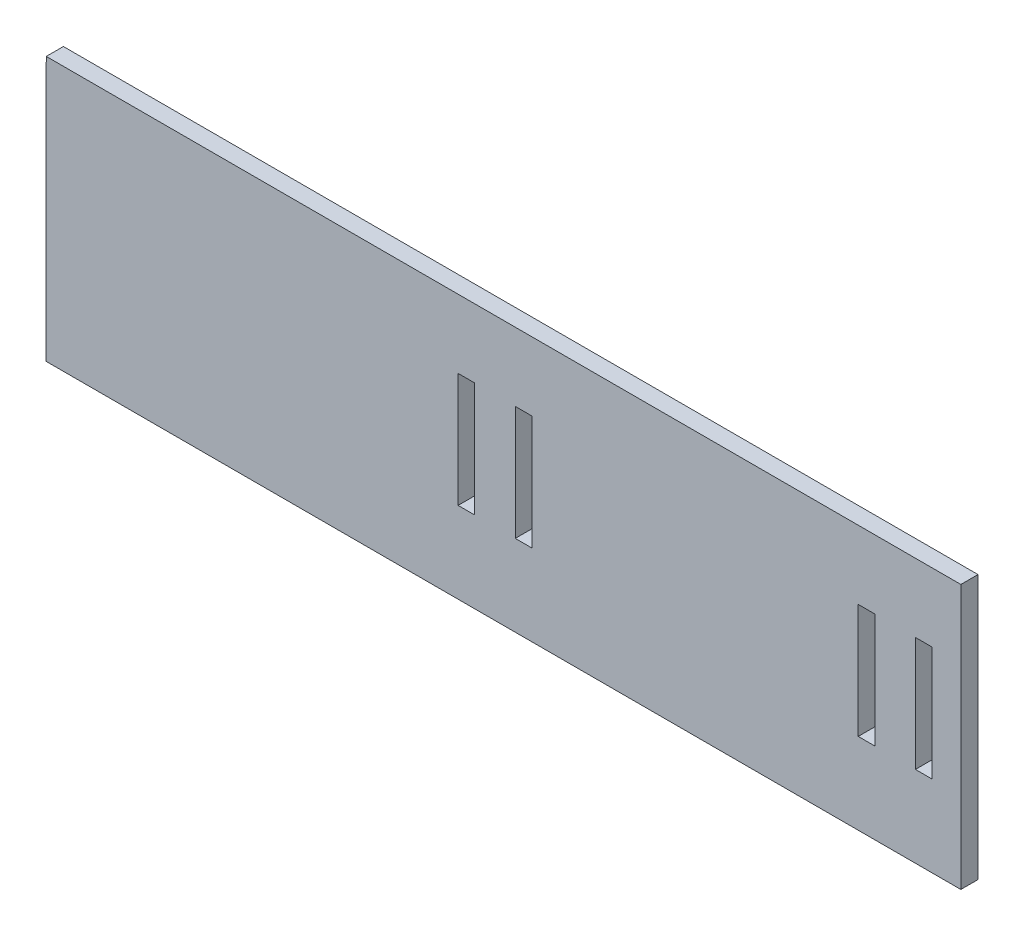
ISO-10303-21;
HEADER;
FILE_DESCRIPTION(('STEP AP214'),'2;1');
FILE_NAME('part.step','',(''),(''),'','','');
FILE_SCHEMA(('AUTOMOTIVE_DESIGN { 1 0 10303 214 1 1 1 1 }'));
ENDSEC;
DATA;
#1=APPLICATION_CONTEXT('core data for automotive mechanical design processes');
#2=APPLICATION_PROTOCOL_DEFINITION('international standard','automotive_design',2000,#1);
#3=PRODUCT_CONTEXT('',#1,'mechanical');
#4=PRODUCT('Part','Part','',(#3));
#5=PRODUCT_RELATED_PRODUCT_CATEGORY('part','',(#4));
#6=PRODUCT_DEFINITION_FORMATION('','',#4);
#7=PRODUCT_DEFINITION_CONTEXT('part definition',#1,'design');
#8=PRODUCT_DEFINITION('design','',#6,#7);
#9=PRODUCT_DEFINITION_SHAPE('','',#8);
#10=(LENGTH_UNIT() NAMED_UNIT(*) SI_UNIT(.MILLI.,.METRE.));
#11=(NAMED_UNIT(*) PLANE_ANGLE_UNIT() SI_UNIT($,.RADIAN.));
#12=(NAMED_UNIT(*) SI_UNIT($,.STERADIAN.) SOLID_ANGLE_UNIT());
#13=UNCERTAINTY_MEASURE_WITH_UNIT(LENGTH_MEASURE(1.E-05),#10,'distance_accuracy_value','');
#14=(GEOMETRIC_REPRESENTATION_CONTEXT(3) GLOBAL_UNCERTAINTY_ASSIGNED_CONTEXT((#13)) GLOBAL_UNIT_ASSIGNED_CONTEXT((#10,
#11,#12)) REPRESENTATION_CONTEXT('',''));
#15=CARTESIAN_POINT('',(0.,0.,0.));
#16=DIRECTION('',(0.,0.,1.));
#17=DIRECTION('',(1.,0.,0.));
#18=AXIS2_PLACEMENT_3D('',#15,#16,#17);
#19=CARTESIAN_POINT('',(87.9999999999733,95.7350879109308,3.00000000000001));
#20=DIRECTION('',(-1.,0.,0.));
#21=DIRECTION('',(0.,-1.,0.));
#22=AXIS2_PLACEMENT_3D('',#19,#20,#21);
#23=PLANE('',#22);
#24=DIRECTION('',(0.,1.,0.));
#25=VECTOR('',#24,1.);
#26=CARTESIAN_POINT('',(87.9999999999733,95.7350879109308,0.));
#27=LINE('',#26,#25);
#28=CARTESIAN_POINT('',(87.9999999999733,49.5183759496248,0.));
#29=VERTEX_POINT('',#28);
#30=CARTESIAN_POINT('',(87.9999999999733,95.7350879109308,0.));
#31=VERTEX_POINT('',#30);
#32=EDGE_CURVE('E296',#29,#31,#27,.T.);
#33=ORIENTED_EDGE('',*,*,#32,.T.);
#34=DIRECTION('',(0.,0.,-1.));
#35=VECTOR('',#34,1.);
#36=CARTESIAN_POINT('',(87.9999999999733,95.7350879109308,3.00000000000001));
#37=LINE('',#36,#35);
#38=CARTESIAN_POINT('',(87.9999999999733,95.7350879109308,3.00000000000001));
#39=VERTEX_POINT('',#38);
#40=EDGE_CURVE('E11',#39,#31,#37,.T.);
#41=ORIENTED_EDGE('',*,*,#40,.F.);
#42=DIRECTION('',(0.,1.,0.));
#43=VECTOR('',#42,1.);
#44=CARTESIAN_POINT('',(87.9999999999733,95.7350879109308,3.00000000000001));
#45=LINE('',#44,#43);
#46=CARTESIAN_POINT('',(87.9999999999733,49.5183759496248,3.00000000000001));
#47=VERTEX_POINT('',#46);
#48=EDGE_CURVE('E303',#47,#39,#45,.T.);
#49=ORIENTED_EDGE('',*,*,#48,.F.);
#50=DIRECTION('',(0.,0.,-1.));
#51=VECTOR('',#50,1.);
#52=CARTESIAN_POINT('',(87.9999999999733,49.5183759496248,3.00000000000001));
#53=LINE('',#52,#51);
#54=EDGE_CURVE('E313',#47,#29,#53,.T.);
#55=ORIENTED_EDGE('',*,*,#54,.T.);
#56=EDGE_LOOP('',(#33,#41,#49,#55));
#57=FACE_BOUND('',#56,.T.);
#58=ADVANCED_FACE('F34',(#57),#23,.F.);
#59=CARTESIAN_POINT('',(87.9999999999733,95.7350879109308,3.00000000000001));
#60=DIRECTION('',(0.,-1.,0.));
#61=DIRECTION('',(1.,0.,0.));
#62=AXIS2_PLACEMENT_3D('',#59,#60,#61);
#63=PLANE('',#62);
#64=DIRECTION('',(-1.,0.,0.));
#65=VECTOR('',#64,1.);
#66=CARTESIAN_POINT('',(87.9999999999733,95.7350879109308,0.));
#67=LINE('',#66,#65);
#68=CARTESIAN_POINT('',(-72.0000742538162,95.7350879109311,0.));
#69=VERTEX_POINT('',#68);
#70=EDGE_CURVE('E316',#31,#69,#67,.T.);
#71=ORIENTED_EDGE('',*,*,#70,.T.);
#72=DIRECTION('',(0.,0.,-1.));
#73=VECTOR('',#72,1.);
#74=CARTESIAN_POINT('',(-72.0000742538162,95.7350879109311,3.00000000000001));
#75=LINE('',#74,#73);
#76=CARTESIAN_POINT('',(-72.0000742538162,95.7350879109311,3.00000000000001));
#77=VERTEX_POINT('',#76);
#78=EDGE_CURVE('E41',#77,#69,#75,.T.);
#79=ORIENTED_EDGE('',*,*,#78,.F.);
#80=DIRECTION('',(-1.,0.,0.));
#81=VECTOR('',#80,1.);
#82=CARTESIAN_POINT('',(87.9999999999733,95.7350879109308,3.00000000000001));
#83=LINE('',#82,#81);
#84=EDGE_CURVE('E306',#39,#77,#83,.T.);
#85=ORIENTED_EDGE('',*,*,#84,.F.);
#86=ORIENTED_EDGE('',*,*,#40,.T.);
#87=EDGE_LOOP('',(#71,#79,#85,#86));
#88=FACE_BOUND('',#87,.T.);
#89=ADVANCED_FACE('F345',(#88),#63,.F.);
#90=CARTESIAN_POINT('',(-72.0000742538162,95.7350879109311,3.00000000000001));
#91=DIRECTION('',(0.999999535914031,-0.000963416692323186,0.));
#92=DIRECTION('',(0.000963416692323186,0.999999535914031,0.));
#93=AXIS2_PLACEMENT_3D('',#90,#91,#92);
#94=PLANE('',#93);
#95=DIRECTION('',(-0.000963416692323185,-0.999999535914031,0.));
#96=VECTOR('',#95,1.);
#97=CARTESIAN_POINT('',(-72.0000742538162,95.7350879109311,0.));
#98=LINE('',#97,#96);
#99=CARTESIAN_POINT('',(-72.0446002262479,49.5183759496247,0.));
#100=VERTEX_POINT('',#99);
#101=EDGE_CURVE('E318',#69,#100,#98,.T.);
#102=ORIENTED_EDGE('',*,*,#101,.T.);
#103=DIRECTION('',(0.,0.,-1.));
#104=VECTOR('',#103,1.);
#105=CARTESIAN_POINT('',(-72.0446002262479,49.5183759496247,3.00000000000001));
#106=LINE('',#105,#104);
#107=CARTESIAN_POINT('',(-72.0446002262479,49.5183759496247,3.00000000000001));
#108=VERTEX_POINT('',#107);
#109=EDGE_CURVE('E323',#108,#100,#106,.T.);
#110=ORIENTED_EDGE('',*,*,#109,.F.);
#111=DIRECTION('',(-0.000963416692323185,-0.999999535914031,0.));
#112=VECTOR('',#111,1.);
#113=CARTESIAN_POINT('',(-72.0000742538162,95.7350879109311,3.00000000000001));
#114=LINE('',#113,#112);
#115=EDGE_CURVE('E309',#77,#108,#114,.T.);
#116=ORIENTED_EDGE('',*,*,#115,.F.);
#117=ORIENTED_EDGE('',*,*,#78,.T.);
#118=EDGE_LOOP('',(#102,#110,#116,#117));
#119=FACE_BOUND('',#118,.T.);
#120=ADVANCED_FACE('F330',(#119),#94,.F.);
#121=CARTESIAN_POINT('',(87.9999999999733,49.5183759496248,3.00000000000001));
#122=DIRECTION('',(0.,1.,0.));
#123=DIRECTION('',(-1.,0.,0.));
#124=AXIS2_PLACEMENT_3D('',#121,#122,#123);
#125=PLANE('',#124);
#126=DIRECTION('',(1.,0.,0.));
#127=VECTOR('',#126,1.);
#128=CARTESIAN_POINT('',(87.9999999999733,49.5183759496248,0.));
#129=LINE('',#128,#127);
#130=EDGE_CURVE('E307',#100,#29,#129,.T.);
#131=ORIENTED_EDGE('',*,*,#130,.T.);
#132=ORIENTED_EDGE('',*,*,#54,.F.);
#133=DIRECTION('',(1.,0.,0.));
#134=VECTOR('',#133,1.);
#135=CARTESIAN_POINT('',(87.9999999999733,49.5183759496248,3.00000000000001));
#136=LINE('',#135,#134);
#137=EDGE_CURVE('E311',#108,#47,#136,.T.);
#138=ORIENTED_EDGE('',*,*,#137,.F.);
#139=ORIENTED_EDGE('',*,*,#109,.T.);
#140=EDGE_LOOP('',(#131,#132,#138,#139));
#141=FACE_BOUND('',#140,.T.);
#142=ADVANCED_FACE('F338',(#141),#125,.F.);
#143=CARTESIAN_POINT('',(0.,0.,3.));
#144=DIRECTION('',(0.,0.,-1.));
#145=DIRECTION('',(0.,1.,0.));
#146=AXIS2_PLACEMENT_3D('',#143,#144,#145);
#147=PLANE('',#146);
#148=DIRECTION('',(1.,0.,0.));
#149=VECTOR('',#148,1.);
#150=CARTESIAN_POINT('',(80.0499999999733,63.7350879109455,3.));
#151=LINE('',#150,#149);
#152=CARTESIAN_POINT('',(80.0499999999733,63.7350879109455,3.00000000000001));
#153=VERTEX_POINT('',#152);
#154=CARTESIAN_POINT('',(82.9499999999733,63.7350879109455,3.));
#155=VERTEX_POINT('',#154);
#156=EDGE_CURVE('E197',#153,#155,#151,.T.);
#157=ORIENTED_EDGE('',*,*,#156,.F.);
#158=DIRECTION('',(0.,-1.,0.));
#159=VECTOR('',#158,1.);
#160=CARTESIAN_POINT('',(80.0499999999733,83.7350879109454,3.));
#161=LINE('',#160,#159);
#162=CARTESIAN_POINT('',(80.0499999999733,83.7350879109454,3.));
#163=VERTEX_POINT('',#162);
#164=EDGE_CURVE('E48',#163,#153,#161,.T.);
#165=ORIENTED_EDGE('',*,*,#164,.F.);
#166=DIRECTION('',(-1.,0.,0.));
#167=VECTOR('',#166,1.);
#168=CARTESIAN_POINT('',(80.0499999999733,83.7350879109454,3.));
#169=LINE('',#168,#167);
#170=CARTESIAN_POINT('',(82.9499999999733,83.7350879109454,3.));
#171=VERTEX_POINT('',#170);
#172=EDGE_CURVE('E188',#171,#163,#169,.T.);
#173=ORIENTED_EDGE('',*,*,#172,.F.);
#174=DIRECTION('',(0.,1.,0.));
#175=VECTOR('',#174,1.);
#176=CARTESIAN_POINT('',(82.9499999999733,83.7350879109454,3.));
#177=LINE('',#176,#175);
#178=EDGE_CURVE('E191',#155,#171,#177,.T.);
#179=ORIENTED_EDGE('',*,*,#178,.F.);
#180=EDGE_LOOP('',(#157,#165,#173,#179));
#181=FACE_BOUND('',#180,.T.);
#182=DIRECTION('',(1.,0.,0.));
#183=VECTOR('',#182,1.);
#184=CARTESIAN_POINT('',(70.0499999999973,63.735087910931,3.));
#185=LINE('',#184,#183);
#186=CARTESIAN_POINT('',(70.0499999999973,63.735087910931,3.00000000000001));
#187=VERTEX_POINT('',#186);
#188=CARTESIAN_POINT('',(72.9499999999973,63.735087910931,3.));
#189=VERTEX_POINT('',#188);
#190=EDGE_CURVE('E222',#187,#189,#185,.T.);
#191=ORIENTED_EDGE('',*,*,#190,.F.);
#192=DIRECTION('',(0.,-1.,0.));
#193=VECTOR('',#192,1.);
#194=CARTESIAN_POINT('',(70.0499999999973,83.7350879109296,3.));
#195=LINE('',#194,#193);
#196=CARTESIAN_POINT('',(70.0499999999973,83.7350879109296,3.));
#197=VERTEX_POINT('',#196);
#198=EDGE_CURVE('E203',#197,#187,#195,.T.);
#199=ORIENTED_EDGE('',*,*,#198,.F.);
#200=DIRECTION('',(-1.,0.,0.));
#201=VECTOR('',#200,1.);
#202=CARTESIAN_POINT('',(70.0499999999973,83.7350879109296,3.));
#203=LINE('',#202,#201);
#204=CARTESIAN_POINT('',(72.9499999999973,83.7350879109296,3.));
#205=VERTEX_POINT('',#204);
#206=EDGE_CURVE('E211',#205,#197,#203,.T.);
#207=ORIENTED_EDGE('',*,*,#206,.F.);
#208=DIRECTION('',(0.,1.,0.));
#209=VECTOR('',#208,1.);
#210=CARTESIAN_POINT('',(72.9499999999973,83.7350879109296,3.));
#211=LINE('',#210,#209);
#212=EDGE_CURVE('E225',#189,#205,#211,.T.);
#213=ORIENTED_EDGE('',*,*,#212,.F.);
#214=EDGE_LOOP('',(#191,#199,#207,#213));
#215=FACE_BOUND('',#214,.T.);
#216=DIRECTION('',(1.,0.,0.));
#217=VECTOR('',#216,1.);
#218=CARTESIAN_POINT('',(10.0499999999965,63.735087910931,3.));
#219=LINE('',#218,#217);
#220=CARTESIAN_POINT('',(10.0499999999965,63.735087910931,3.00000000000001));
#221=VERTEX_POINT('',#220);
#222=CARTESIAN_POINT('',(12.9499999999965,63.735087910931,3.));
#223=VERTEX_POINT('',#222);
#224=EDGE_CURVE('E254',#221,#223,#219,.T.);
#225=ORIENTED_EDGE('',*,*,#224,.F.);
#226=DIRECTION('',(0.,-1.,0.));
#227=VECTOR('',#226,1.);
#228=CARTESIAN_POINT('',(10.0499999999965,83.735087910931,3.));
#229=LINE('',#228,#227);
#230=CARTESIAN_POINT('',(10.0499999999965,83.735087910931,3.));
#231=VERTEX_POINT('',#230);
#232=EDGE_CURVE('E232',#231,#221,#229,.T.);
#233=ORIENTED_EDGE('',*,*,#232,.F.);
#234=DIRECTION('',(-1.,0.,0.));
#235=VECTOR('',#234,1.);
#236=CARTESIAN_POINT('',(10.0499999999965,83.735087910931,3.));
#237=LINE('',#236,#235);
#238=CARTESIAN_POINT('',(12.9499999999965,83.735087910931,3.));
#239=VERTEX_POINT('',#238);
#240=EDGE_CURVE('E243',#239,#231,#237,.T.);
#241=ORIENTED_EDGE('',*,*,#240,.F.);
#242=DIRECTION('',(0.,1.,0.));
#243=VECTOR('',#242,1.);
#244=CARTESIAN_POINT('',(12.9499999999965,83.735087910931,3.));
#245=LINE('',#244,#243);
#246=EDGE_CURVE('E257',#223,#239,#245,.T.);
#247=ORIENTED_EDGE('',*,*,#246,.F.);
#248=EDGE_LOOP('',(#225,#233,#241,#247));
#249=FACE_BOUND('',#248,.T.);
#250=DIRECTION('',(1.,0.,0.));
#251=VECTOR('',#250,1.);
#252=CARTESIAN_POINT('',(0.0500000000000025,63.7350879109133,3.));
#253=LINE('',#252,#251);
#254=CARTESIAN_POINT('',(0.0500000000000025,63.7350879109133,3.00000000000001));
#255=VERTEX_POINT('',#254);
#256=CARTESIAN_POINT('',(2.95,63.7350879109133,3.));
#257=VERTEX_POINT('',#256);
#258=EDGE_CURVE('E286',#255,#257,#253,.T.);
#259=ORIENTED_EDGE('',*,*,#258,.F.);
#260=DIRECTION('',(0.,-1.,0.));
#261=VECTOR('',#260,1.);
#262=CARTESIAN_POINT('',(0.0500000000000001,83.7350879109133,3.));
#263=LINE('',#262,#261);
#264=CARTESIAN_POINT('',(0.0500000000000001,83.7350879109133,3.));
#265=VERTEX_POINT('',#264);
#266=EDGE_CURVE('E264',#265,#255,#263,.T.);
#267=ORIENTED_EDGE('',*,*,#266,.F.);
#268=DIRECTION('',(-1.,0.,0.));
#269=VECTOR('',#268,1.);
#270=CARTESIAN_POINT('',(0.0500000000000001,83.7350879109133,3.));
#271=LINE('',#270,#269);
#272=CARTESIAN_POINT('',(2.95,83.7350879109133,3.));
#273=VERTEX_POINT('',#272);
#274=EDGE_CURVE('E275',#273,#265,#271,.T.);
#275=ORIENTED_EDGE('',*,*,#274,.F.);
#276=DIRECTION('',(0.,1.,0.));
#277=VECTOR('',#276,1.);
#278=CARTESIAN_POINT('',(2.95,83.7350879109133,3.));
#279=LINE('',#278,#277);
#280=EDGE_CURVE('E289',#257,#273,#279,.T.);
#281=ORIENTED_EDGE('',*,*,#280,.F.);
#282=EDGE_LOOP('',(#259,#267,#275,#281));
#283=FACE_BOUND('',#282,.T.);
#284=ORIENTED_EDGE('',*,*,#48,.T.);
#285=ORIENTED_EDGE('',*,*,#84,.T.);
#286=ORIENTED_EDGE('',*,*,#115,.T.);
#287=ORIENTED_EDGE('',*,*,#137,.T.);
#288=EDGE_LOOP('',(#284,#285,#286,#287));
#289=FACE_BOUND('',#288,.T.);
#290=ADVANCED_FACE('F344',(#181,#215,#249,#283,#289),#147,.F.);
#291=CARTESIAN_POINT('',(0.,0.,0.));
#292=DIRECTION('',(0.,0.,-1.));
#293=DIRECTION('',(0.,1.,0.));
#294=AXIS2_PLACEMENT_3D('',#291,#292,#293);
#295=PLANE('',#294);
#296=DIRECTION('',(0.,-1.,0.));
#297=VECTOR('',#296,1.);
#298=CARTESIAN_POINT('',(80.0499999999733,83.7350879109454,0.));
#299=LINE('',#298,#297);
#300=CARTESIAN_POINT('',(80.0499999999733,83.7350879109454,0.));
#301=VERTEX_POINT('',#300);
#302=CARTESIAN_POINT('',(80.0499999999733,63.7350879109455,0.));
#303=VERTEX_POINT('',#302);
#304=EDGE_CURVE('E172',#301,#303,#299,.T.);
#305=ORIENTED_EDGE('',*,*,#304,.T.);
#306=DIRECTION('',(1.,0.,0.));
#307=VECTOR('',#306,1.);
#308=CARTESIAN_POINT('',(80.0499999999733,63.7350879109455,0.));
#309=LINE('',#308,#307);
#310=CARTESIAN_POINT('',(82.9499999999733,63.7350879109455,0.));
#311=VERTEX_POINT('',#310);
#312=EDGE_CURVE('E181',#303,#311,#309,.T.);
#313=ORIENTED_EDGE('',*,*,#312,.T.);
#314=DIRECTION('',(0.,1.,0.));
#315=VECTOR('',#314,1.);
#316=CARTESIAN_POINT('',(82.9499999999733,83.7350879109454,0.));
#317=LINE('',#316,#315);
#318=CARTESIAN_POINT('',(82.9499999999733,83.7350879109454,0.));
#319=VERTEX_POINT('',#318);
#320=EDGE_CURVE('E56',#311,#319,#317,.T.);
#321=ORIENTED_EDGE('',*,*,#320,.T.);
#322=DIRECTION('',(-1.,0.,0.));
#323=VECTOR('',#322,1.);
#324=CARTESIAN_POINT('',(80.0499999999733,83.7350879109454,0.));
#325=LINE('',#324,#323);
#326=EDGE_CURVE('E178',#319,#301,#325,.T.);
#327=ORIENTED_EDGE('',*,*,#326,.T.);
#328=EDGE_LOOP('',(#305,#313,#321,#327));
#329=FACE_BOUND('',#328,.T.);
#330=DIRECTION('',(0.,-1.,0.));
#331=VECTOR('',#330,1.);
#332=CARTESIAN_POINT('',(70.0499999999973,83.7350879109296,0.));
#333=LINE('',#332,#331);
#334=CARTESIAN_POINT('',(70.0499999999973,83.7350879109296,0.));
#335=VERTEX_POINT('',#334);
#336=CARTESIAN_POINT('',(70.0499999999973,63.735087910931,0.));
#337=VERTEX_POINT('',#336);
#338=EDGE_CURVE('E207',#335,#337,#333,.T.);
#339=ORIENTED_EDGE('',*,*,#338,.T.);
#340=DIRECTION('',(1.,0.,0.));
#341=VECTOR('',#340,1.);
#342=CARTESIAN_POINT('',(70.0499999999973,63.735087910931,0.));
#343=LINE('',#342,#341);
#344=CARTESIAN_POINT('',(72.9499999999973,63.735087910931,0.));
#345=VERTEX_POINT('',#344);
#346=EDGE_CURVE('E210',#337,#345,#343,.T.);
#347=ORIENTED_EDGE('',*,*,#346,.T.);
#348=DIRECTION('',(0.,1.,0.));
#349=VECTOR('',#348,1.);
#350=CARTESIAN_POINT('',(72.9499999999973,83.7350879109296,0.));
#351=LINE('',#350,#349);
#352=CARTESIAN_POINT('',(72.9499999999973,83.7350879109296,0.));
#353=VERTEX_POINT('',#352);
#354=EDGE_CURVE('E214',#345,#353,#351,.T.);
#355=ORIENTED_EDGE('',*,*,#354,.T.);
#356=DIRECTION('',(-1.,0.,0.));
#357=VECTOR('',#356,1.);
#358=CARTESIAN_POINT('',(70.0499999999973,83.7350879109296,0.));
#359=LINE('',#358,#357);
#360=EDGE_CURVE('E217',#353,#335,#359,.T.);
#361=ORIENTED_EDGE('',*,*,#360,.T.);
#362=EDGE_LOOP('',(#339,#347,#355,#361));
#363=FACE_BOUND('',#362,.T.);
#364=DIRECTION('',(0.,-1.,0.));
#365=VECTOR('',#364,1.);
#366=CARTESIAN_POINT('',(10.0499999999965,83.735087910931,0.));
#367=LINE('',#366,#365);
#368=CARTESIAN_POINT('',(10.0499999999965,83.735087910931,0.));
#369=VERTEX_POINT('',#368);
#370=CARTESIAN_POINT('',(10.0499999999965,63.735087910931,0.));
#371=VERTEX_POINT('',#370);
#372=EDGE_CURVE('E239',#369,#371,#367,.T.);
#373=ORIENTED_EDGE('',*,*,#372,.T.);
#374=DIRECTION('',(1.,0.,0.));
#375=VECTOR('',#374,1.);
#376=CARTESIAN_POINT('',(10.0499999999965,63.735087910931,0.));
#377=LINE('',#376,#375);
#378=CARTESIAN_POINT('',(12.9499999999965,63.735087910931,0.));
#379=VERTEX_POINT('',#378);
#380=EDGE_CURVE('E242',#371,#379,#377,.T.);
#381=ORIENTED_EDGE('',*,*,#380,.T.);
#382=DIRECTION('',(0.,1.,0.));
#383=VECTOR('',#382,1.);
#384=CARTESIAN_POINT('',(12.9499999999965,83.735087910931,0.));
#385=LINE('',#384,#383);
#386=CARTESIAN_POINT('',(12.9499999999965,83.735087910931,0.));
#387=VERTEX_POINT('',#386);
#388=EDGE_CURVE('E246',#379,#387,#385,.T.);
#389=ORIENTED_EDGE('',*,*,#388,.T.);
#390=DIRECTION('',(-1.,0.,0.));
#391=VECTOR('',#390,1.);
#392=CARTESIAN_POINT('',(10.0499999999965,83.735087910931,0.));
#393=LINE('',#392,#391);
#394=EDGE_CURVE('E249',#387,#369,#393,.T.);
#395=ORIENTED_EDGE('',*,*,#394,.T.);
#396=EDGE_LOOP('',(#373,#381,#389,#395));
#397=FACE_BOUND('',#396,.T.);
#398=DIRECTION('',(0.,-1.,0.));
#399=VECTOR('',#398,1.);
#400=CARTESIAN_POINT('',(0.0500000000000001,83.7350879109133,0.));
#401=LINE('',#400,#399);
#402=CARTESIAN_POINT('',(0.0500000000000001,83.7350879109133,0.));
#403=VERTEX_POINT('',#402);
#404=CARTESIAN_POINT('',(0.0500000000000025,63.7350879109133,0.));
#405=VERTEX_POINT('',#404);
#406=EDGE_CURVE('E271',#403,#405,#401,.T.);
#407=ORIENTED_EDGE('',*,*,#406,.T.);
#408=DIRECTION('',(1.,0.,0.));
#409=VECTOR('',#408,1.);
#410=CARTESIAN_POINT('',(0.0500000000000025,63.7350879109133,0.));
#411=LINE('',#410,#409);
#412=CARTESIAN_POINT('',(2.95,63.7350879109133,0.));
#413=VERTEX_POINT('',#412);
#414=EDGE_CURVE('E274',#405,#413,#411,.T.);
#415=ORIENTED_EDGE('',*,*,#414,.T.);
#416=DIRECTION('',(0.,1.,0.));
#417=VECTOR('',#416,1.);
#418=CARTESIAN_POINT('',(2.95,83.7350879109133,0.));
#419=LINE('',#418,#417);
#420=CARTESIAN_POINT('',(2.95,83.7350879109133,0.));
#421=VERTEX_POINT('',#420);
#422=EDGE_CURVE('E278',#413,#421,#419,.T.);
#423=ORIENTED_EDGE('',*,*,#422,.T.);
#424=DIRECTION('',(-1.,0.,0.));
#425=VECTOR('',#424,1.);
#426=CARTESIAN_POINT('',(0.0500000000000001,83.7350879109133,0.));
#427=LINE('',#426,#425);
#428=EDGE_CURVE('E281',#421,#403,#427,.T.);
#429=ORIENTED_EDGE('',*,*,#428,.T.);
#430=EDGE_LOOP('',(#407,#415,#423,#429));
#431=FACE_BOUND('',#430,.T.);
#432=ORIENTED_EDGE('',*,*,#32,.F.);
#433=ORIENTED_EDGE('',*,*,#130,.F.);
#434=ORIENTED_EDGE('',*,*,#101,.F.);
#435=ORIENTED_EDGE('',*,*,#70,.F.);
#436=EDGE_LOOP('',(#432,#433,#434,#435));
#437=FACE_BOUND('',#436,.T.);
#438=ADVANCED_FACE('F185',(#329,#363,#397,#431,#437),#295,.T.);
#439=CARTESIAN_POINT('',(0.0500000000000001,83.7350879109133,0.));
#440=DIRECTION('',(-1.,0.,0.));
#441=DIRECTION('',(0.,-1.,0.));
#442=AXIS2_PLACEMENT_3D('',#439,#440,#441);
#443=PLANE('',#442);
#444=ORIENTED_EDGE('',*,*,#266,.T.);
#445=DIRECTION('',(0.,0.,1.));
#446=VECTOR('',#445,1.);
#447=CARTESIAN_POINT('',(0.0500000000000025,63.7350879109133,0.));
#448=LINE('',#447,#446);
#449=EDGE_CURVE('E284',#405,#255,#448,.T.);
#450=ORIENTED_EDGE('',*,*,#449,.F.);
#451=ORIENTED_EDGE('',*,*,#406,.F.);
#452=DIRECTION('',(0.,0.,1.));
#453=VECTOR('',#452,1.);
#454=CARTESIAN_POINT('',(0.0500000000000001,83.7350879109133,0.));
#455=LINE('',#454,#453);
#456=EDGE_CURVE('E294',#403,#265,#455,.T.);
#457=ORIENTED_EDGE('',*,*,#456,.T.);
#458=EDGE_LOOP('',(#444,#450,#451,#457));
#459=FACE_BOUND('',#458,.T.);
#460=ADVANCED_FACE('F357',(#459),#443,.F.);
#461=CARTESIAN_POINT('',(0.0500000000000001,83.7350879109133,0.));
#462=DIRECTION('',(0.,1.,0.));
#463=DIRECTION('',(0.,0.,1.));
#464=AXIS2_PLACEMENT_3D('',#461,#462,#463);
#465=PLANE('',#464);
#466=ORIENTED_EDGE('',*,*,#274,.T.);
#467=ORIENTED_EDGE('',*,*,#456,.F.);
#468=ORIENTED_EDGE('',*,*,#428,.F.);
#469=DIRECTION('',(0.,0.,1.));
#470=VECTOR('',#469,1.);
#471=CARTESIAN_POINT('',(2.95,83.7350879109133,0.));
#472=LINE('',#471,#470);
#473=EDGE_CURVE('E297',#421,#273,#472,.T.);
#474=ORIENTED_EDGE('',*,*,#473,.T.);
#475=EDGE_LOOP('',(#466,#467,#468,#474));
#476=FACE_BOUND('',#475,.T.);
#477=ADVANCED_FACE('F363',(#476),#465,.F.);
#478=CARTESIAN_POINT('',(2.95,83.7350879109133,0.));
#479=DIRECTION('',(1.,0.,0.));
#480=DIRECTION('',(0.,1.,0.));
#481=AXIS2_PLACEMENT_3D('',#478,#479,#480);
#482=PLANE('',#481);
#483=ORIENTED_EDGE('',*,*,#280,.T.);
#484=ORIENTED_EDGE('',*,*,#473,.F.);
#485=ORIENTED_EDGE('',*,*,#422,.F.);
#486=DIRECTION('',(0.,0.,1.));
#487=VECTOR('',#486,1.);
#488=CARTESIAN_POINT('',(2.95,63.7350879109133,0.));
#489=LINE('',#488,#487);
#490=EDGE_CURVE('E299',#413,#257,#489,.T.);
#491=ORIENTED_EDGE('',*,*,#490,.T.);
#492=EDGE_LOOP('',(#483,#484,#485,#491));
#493=FACE_BOUND('',#492,.T.);
#494=ADVANCED_FACE('F369',(#493),#482,.F.);
#495=CARTESIAN_POINT('',(0.0500000000000025,63.7350879109133,0.));
#496=DIRECTION('',(0.,-1.,0.));
#497=DIRECTION('',(0.,0.,-1.));
#498=AXIS2_PLACEMENT_3D('',#495,#496,#497);
#499=PLANE('',#498);
#500=ORIENTED_EDGE('',*,*,#258,.T.);
#501=ORIENTED_EDGE('',*,*,#490,.F.);
#502=ORIENTED_EDGE('',*,*,#414,.F.);
#503=ORIENTED_EDGE('',*,*,#449,.T.);
#504=EDGE_LOOP('',(#500,#501,#502,#503));
#505=FACE_BOUND('',#504,.T.);
#506=ADVANCED_FACE('F365',(#505),#499,.F.);
#507=CARTESIAN_POINT('',(10.0499999999965,83.735087910931,0.));
#508=DIRECTION('',(-1.,0.,0.));
#509=DIRECTION('',(0.,-1.,0.));
#510=AXIS2_PLACEMENT_3D('',#507,#508,#509);
#511=PLANE('',#510);
#512=ORIENTED_EDGE('',*,*,#232,.T.);
#513=DIRECTION('',(0.,0.,1.));
#514=VECTOR('',#513,1.);
#515=CARTESIAN_POINT('',(10.0499999999965,63.735087910931,0.));
#516=LINE('',#515,#514);
#517=EDGE_CURVE('E252',#371,#221,#516,.T.);
#518=ORIENTED_EDGE('',*,*,#517,.F.);
#519=ORIENTED_EDGE('',*,*,#372,.F.);
#520=DIRECTION('',(0.,0.,1.));
#521=VECTOR('',#520,1.);
#522=CARTESIAN_POINT('',(10.0499999999965,83.735087910931,0.));
#523=LINE('',#522,#521);
#524=EDGE_CURVE('E262',#369,#231,#523,.T.);
#525=ORIENTED_EDGE('',*,*,#524,.T.);
#526=EDGE_LOOP('',(#512,#518,#519,#525));
#527=FACE_BOUND('',#526,.T.);
#528=ADVANCED_FACE('F368',(#527),#511,.F.);
#529=CARTESIAN_POINT('',(10.0499999999965,83.735087910931,0.));
#530=DIRECTION('',(0.,1.,0.));
#531=DIRECTION('',(0.,0.,1.));
#532=AXIS2_PLACEMENT_3D('',#529,#530,#531);
#533=PLANE('',#532);
#534=ORIENTED_EDGE('',*,*,#240,.T.);
#535=ORIENTED_EDGE('',*,*,#524,.F.);
#536=ORIENTED_EDGE('',*,*,#394,.F.);
#537=DIRECTION('',(0.,0.,1.));
#538=VECTOR('',#537,1.);
#539=CARTESIAN_POINT('',(12.9499999999965,83.735087910931,0.));
#540=LINE('',#539,#538);
#541=EDGE_CURVE('E265',#387,#239,#540,.T.);
#542=ORIENTED_EDGE('',*,*,#541,.T.);
#543=EDGE_LOOP('',(#534,#535,#536,#542));
#544=FACE_BOUND('',#543,.T.);
#545=ADVANCED_FACE('F379',(#544),#533,.F.);
#546=CARTESIAN_POINT('',(12.9499999999965,83.735087910931,0.));
#547=DIRECTION('',(1.,0.,0.));
#548=DIRECTION('',(0.,1.,0.));
#549=AXIS2_PLACEMENT_3D('',#546,#547,#548);
#550=PLANE('',#549);
#551=ORIENTED_EDGE('',*,*,#246,.T.);
#552=ORIENTED_EDGE('',*,*,#541,.F.);
#553=ORIENTED_EDGE('',*,*,#388,.F.);
#554=DIRECTION('',(0.,0.,1.));
#555=VECTOR('',#554,1.);
#556=CARTESIAN_POINT('',(12.9499999999965,63.735087910931,0.));
#557=LINE('',#556,#555);
#558=EDGE_CURVE('E267',#379,#223,#557,.T.);
#559=ORIENTED_EDGE('',*,*,#558,.T.);
#560=EDGE_LOOP('',(#551,#552,#553,#559));
#561=FACE_BOUND('',#560,.T.);
#562=ADVANCED_FACE('F385',(#561),#550,.F.);
#563=CARTESIAN_POINT('',(10.0499999999965,63.735087910931,0.));
#564=DIRECTION('',(0.,-1.,0.));
#565=DIRECTION('',(0.,0.,-1.));
#566=AXIS2_PLACEMENT_3D('',#563,#564,#565);
#567=PLANE('',#566);
#568=ORIENTED_EDGE('',*,*,#224,.T.);
#569=ORIENTED_EDGE('',*,*,#558,.F.);
#570=ORIENTED_EDGE('',*,*,#380,.F.);
#571=ORIENTED_EDGE('',*,*,#517,.T.);
#572=EDGE_LOOP('',(#568,#569,#570,#571));
#573=FACE_BOUND('',#572,.T.);
#574=ADVANCED_FACE('F381',(#573),#567,.F.);
#575=CARTESIAN_POINT('',(70.0499999999973,83.7350879109296,0.));
#576=DIRECTION('',(-1.,0.,0.));
#577=DIRECTION('',(0.,0.,1.));
#578=AXIS2_PLACEMENT_3D('',#575,#576,#577);
#579=PLANE('',#578);
#580=ORIENTED_EDGE('',*,*,#198,.T.);
#581=DIRECTION('',(0.,0.,1.));
#582=VECTOR('',#581,1.);
#583=CARTESIAN_POINT('',(70.0499999999973,63.735087910931,0.));
#584=LINE('',#583,#582);
#585=EDGE_CURVE('E220',#337,#187,#584,.T.);
#586=ORIENTED_EDGE('',*,*,#585,.F.);
#587=ORIENTED_EDGE('',*,*,#338,.F.);
#588=DIRECTION('',(0.,0.,1.));
#589=VECTOR('',#588,1.);
#590=CARTESIAN_POINT('',(70.0499999999973,83.7350879109296,0.));
#591=LINE('',#590,#589);
#592=EDGE_CURVE('E230',#335,#197,#591,.T.);
#593=ORIENTED_EDGE('',*,*,#592,.T.);
#594=EDGE_LOOP('',(#580,#586,#587,#593));
#595=FACE_BOUND('',#594,.T.);
#596=ADVANCED_FACE('F384',(#595),#579,.F.);
#597=CARTESIAN_POINT('',(70.0499999999973,83.7350879109296,0.));
#598=DIRECTION('',(0.,1.,0.));
#599=DIRECTION('',(0.,0.,1.));
#600=AXIS2_PLACEMENT_3D('',#597,#598,#599);
#601=PLANE('',#600);
#602=ORIENTED_EDGE('',*,*,#206,.T.);
#603=ORIENTED_EDGE('',*,*,#592,.F.);
#604=ORIENTED_EDGE('',*,*,#360,.F.);
#605=DIRECTION('',(0.,0.,1.));
#606=VECTOR('',#605,1.);
#607=CARTESIAN_POINT('',(72.9499999999973,83.7350879109296,0.));
#608=LINE('',#607,#606);
#609=EDGE_CURVE('E233',#353,#205,#608,.T.);
#610=ORIENTED_EDGE('',*,*,#609,.T.);
#611=EDGE_LOOP('',(#602,#603,#604,#610));
#612=FACE_BOUND('',#611,.T.);
#613=ADVANCED_FACE('F395',(#612),#601,.F.);
#614=CARTESIAN_POINT('',(72.9499999999973,83.7350879109296,0.));
#615=DIRECTION('',(1.,0.,0.));
#616=DIRECTION('',(0.,0.,-1.));
#617=AXIS2_PLACEMENT_3D('',#614,#615,#616);
#618=PLANE('',#617);
#619=ORIENTED_EDGE('',*,*,#212,.T.);
#620=ORIENTED_EDGE('',*,*,#609,.F.);
#621=ORIENTED_EDGE('',*,*,#354,.F.);
#622=DIRECTION('',(0.,0.,1.));
#623=VECTOR('',#622,1.);
#624=CARTESIAN_POINT('',(72.9499999999973,63.735087910931,0.));
#625=LINE('',#624,#623);
#626=EDGE_CURVE('E235',#345,#189,#625,.T.);
#627=ORIENTED_EDGE('',*,*,#626,.T.);
#628=EDGE_LOOP('',(#619,#620,#621,#627));
#629=FACE_BOUND('',#628,.T.);
#630=ADVANCED_FACE('F400',(#629),#618,.F.);
#631=CARTESIAN_POINT('',(70.0499999999973,63.735087910931,0.));
#632=DIRECTION('',(0.,-1.,0.));
#633=DIRECTION('',(0.,0.,-1.));
#634=AXIS2_PLACEMENT_3D('',#631,#632,#633);
#635=PLANE('',#634);
#636=ORIENTED_EDGE('',*,*,#190,.T.);
#637=ORIENTED_EDGE('',*,*,#626,.F.);
#638=ORIENTED_EDGE('',*,*,#346,.F.);
#639=ORIENTED_EDGE('',*,*,#585,.T.);
#640=EDGE_LOOP('',(#636,#637,#638,#639));
#641=FACE_BOUND('',#640,.T.);
#642=ADVANCED_FACE('F397',(#641),#635,.F.);
#643=CARTESIAN_POINT('',(80.0499999999733,83.7350879109454,0.));
#644=DIRECTION('',(-1.,0.,0.));
#645=DIRECTION('',(0.,0.,1.));
#646=AXIS2_PLACEMENT_3D('',#643,#644,#645);
#647=PLANE('',#646);
#648=ORIENTED_EDGE('',*,*,#164,.T.);
#649=DIRECTION('',(0.,0.,1.));
#650=VECTOR('',#649,1.);
#651=CARTESIAN_POINT('',(80.0499999999733,63.7350879109455,0.));
#652=LINE('',#651,#650);
#653=EDGE_CURVE('E168',#303,#153,#652,.T.);
#654=ORIENTED_EDGE('',*,*,#653,.F.);
#655=ORIENTED_EDGE('',*,*,#304,.F.);
#656=DIRECTION('',(0.,0.,1.));
#657=VECTOR('',#656,1.);
#658=CARTESIAN_POINT('',(80.0499999999733,83.7350879109454,0.));
#659=LINE('',#658,#657);
#660=EDGE_CURVE('E201',#301,#163,#659,.T.);
#661=ORIENTED_EDGE('',*,*,#660,.T.);
#662=EDGE_LOOP('',(#648,#654,#655,#661));
#663=FACE_BOUND('',#662,.T.);
#664=ADVANCED_FACE('F170',(#663),#647,.F.);
#665=CARTESIAN_POINT('',(80.0499999999733,83.7350879109454,0.));
#666=DIRECTION('',(0.,1.,0.));
#667=DIRECTION('',(0.,0.,1.));
#668=AXIS2_PLACEMENT_3D('',#665,#666,#667);
#669=PLANE('',#668);
#670=ORIENTED_EDGE('',*,*,#172,.T.);
#671=ORIENTED_EDGE('',*,*,#660,.F.);
#672=ORIENTED_EDGE('',*,*,#326,.F.);
#673=DIRECTION('',(0.,0.,1.));
#674=VECTOR('',#673,1.);
#675=CARTESIAN_POINT('',(82.9499999999733,83.7350879109454,0.));
#676=LINE('',#675,#674);
#677=EDGE_CURVE('E204',#319,#171,#676,.T.);
#678=ORIENTED_EDGE('',*,*,#677,.T.);
#679=EDGE_LOOP('',(#670,#671,#672,#678));
#680=FACE_BOUND('',#679,.T.);
#681=ADVANCED_FACE('F410',(#680),#669,.F.);
#682=CARTESIAN_POINT('',(82.9499999999733,83.7350879109454,0.));
#683=DIRECTION('',(1.,0.,0.));
#684=DIRECTION('',(0.,0.,-1.));
#685=AXIS2_PLACEMENT_3D('',#682,#683,#684);
#686=PLANE('',#685);
#687=ORIENTED_EDGE('',*,*,#178,.T.);
#688=ORIENTED_EDGE('',*,*,#677,.F.);
#689=ORIENTED_EDGE('',*,*,#320,.F.);
#690=DIRECTION('',(0.,0.,1.));
#691=VECTOR('',#690,1.);
#692=CARTESIAN_POINT('',(82.9499999999733,63.7350879109455,0.));
#693=LINE('',#692,#691);
#694=EDGE_CURVE('E177',#311,#155,#693,.T.);
#695=ORIENTED_EDGE('',*,*,#694,.T.);
#696=EDGE_LOOP('',(#687,#688,#689,#695));
#697=FACE_BOUND('',#696,.T.);
#698=ADVANCED_FACE('F413',(#697),#686,.F.);
#699=CARTESIAN_POINT('',(80.0499999999733,63.7350879109455,0.));
#700=DIRECTION('',(0.,-1.,0.));
#701=DIRECTION('',(0.,0.,-1.));
#702=AXIS2_PLACEMENT_3D('',#699,#700,#701);
#703=PLANE('',#702);
#704=ORIENTED_EDGE('',*,*,#156,.T.);
#705=ORIENTED_EDGE('',*,*,#694,.F.);
#706=ORIENTED_EDGE('',*,*,#312,.F.);
#707=ORIENTED_EDGE('',*,*,#653,.T.);
#708=EDGE_LOOP('',(#704,#705,#706,#707));
#709=FACE_BOUND('',#708,.T.);
#710=ADVANCED_FACE('F182',(#709),#703,.F.);
#711=CLOSED_SHELL('',(#58,#89,#120,#142,#290,#438,#460,#477,#494,#506,#528,#545,#562,#574,#596,
#613,#630,#642,#664,#681,#698,#710));
#712=MANIFOLD_SOLID_BREP('B2',#711);
#713=ADVANCED_BREP_SHAPE_REPRESENTATION('',(#18,#712),#14);
#714=SHAPE_DEFINITION_REPRESENTATION(#9,#713);
ENDSEC;
END-ISO-10303-21;
